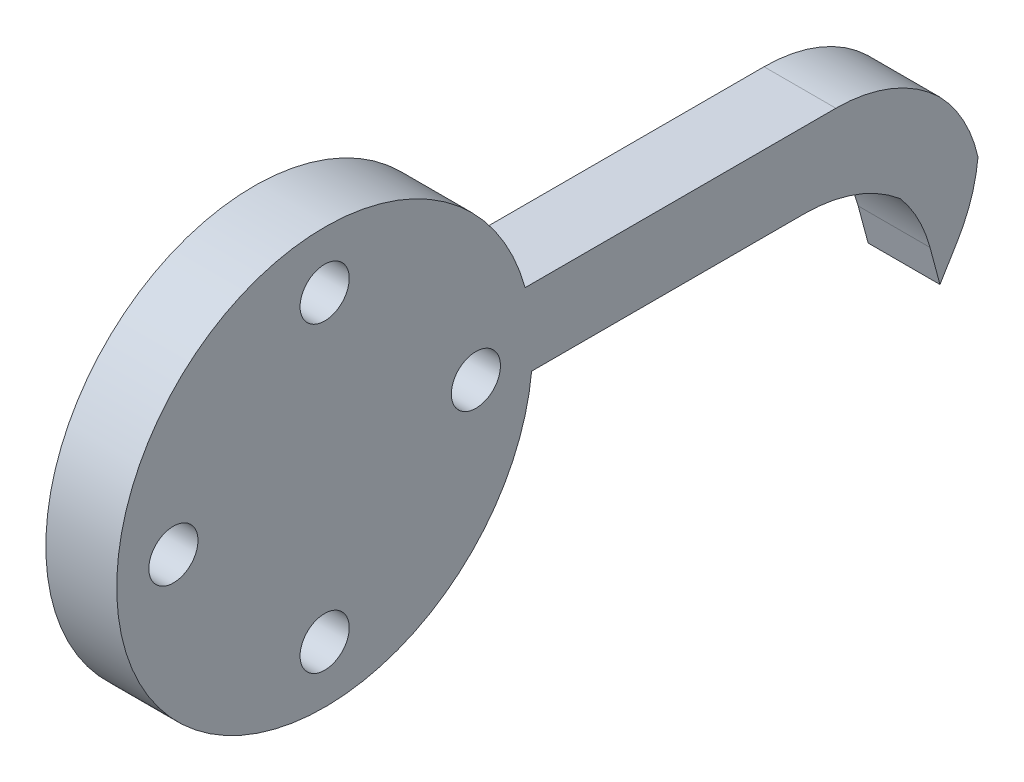
ISO-10303-21;
HEADER;
FILE_DESCRIPTION(('STEP AP214'),'2;1');
FILE_NAME('part.step','',(''),(''),'','','');
FILE_SCHEMA(('AUTOMOTIVE_DESIGN { 1 0 10303 214 1 1 1 1 }'));
ENDSEC;
DATA;
#1=APPLICATION_CONTEXT('core data for automotive mechanical design processes');
#2=APPLICATION_PROTOCOL_DEFINITION('international standard','automotive_design',2000,#1);
#3=PRODUCT_CONTEXT('',#1,'mechanical');
#4=PRODUCT('Part','Part','',(#3));
#5=PRODUCT_RELATED_PRODUCT_CATEGORY('part','',(#4));
#6=PRODUCT_DEFINITION_FORMATION('','',#4);
#7=PRODUCT_DEFINITION_CONTEXT('part definition',#1,'design');
#8=PRODUCT_DEFINITION('design','',#6,#7);
#9=PRODUCT_DEFINITION_SHAPE('','',#8);
#10=(LENGTH_UNIT() NAMED_UNIT(*) SI_UNIT(.MILLI.,.METRE.));
#11=(NAMED_UNIT(*) PLANE_ANGLE_UNIT() SI_UNIT($,.RADIAN.));
#12=(NAMED_UNIT(*) SI_UNIT($,.STERADIAN.) SOLID_ANGLE_UNIT());
#13=UNCERTAINTY_MEASURE_WITH_UNIT(LENGTH_MEASURE(1.E-05),#10,'distance_accuracy_value','');
#14=(GEOMETRIC_REPRESENTATION_CONTEXT(3) GLOBAL_UNCERTAINTY_ASSIGNED_CONTEXT((#13)) GLOBAL_UNIT_ASSIGNED_CONTEXT((#10,
#11,#12)) REPRESENTATION_CONTEXT('',''));
#15=CARTESIAN_POINT('',(0.,0.,0.));
#16=DIRECTION('',(0.,0.,1.));
#17=DIRECTION('',(1.,0.,0.));
#18=AXIS2_PLACEMENT_3D('',#15,#16,#17);
#19=CARTESIAN_POINT('',(4.7625,0.,0.));
#20=DIRECTION('',(1.,0.,0.));
#21=DIRECTION('',(0.,0.,-1.));
#22=AXIS2_PLACEMENT_3D('',#19,#20,#21);
#23=PLANE('',#22);
#24=CARTESIAN_POINT('',(4.7625,-6.07166926218671,-34.1297947618021));
#25=DIRECTION('',(1.,0.,0.));
#26=DIRECTION('',(0.,0.,-1.));
#27=AXIS2_PLACEMENT_3D('',#24,#25,#26);
#28=CIRCLE('',#27,10.);
#29=CARTESIAN_POINT('',(4.7625,-3.90232573338417,-43.8916567078677));
#30=VERTEX_POINT('',#29);
#31=CARTESIAN_POINT('',(4.7625,0.891421535927287,-41.3072153665334));
#32=VERTEX_POINT('',#31);
#33=EDGE_CURVE('E223',#30,#32,#28,.T.);
#34=ORIENTED_EDGE('',*,*,#33,.T.);
#35=CARTESIAN_POINT('',(4.7625,-6.28599906880401,-34.3441245684194));
#36=DIRECTION('',(1.,0.,0.));
#37=DIRECTION('',(0.,0.,-1.));
#38=AXIS2_PLACEMENT_3D('',#35,#36,#37);
#39=CIRCLE('',#38,10.);
#40=CARTESIAN_POINT('',(4.7625,3.71400093119599,-34.3441245684195));
#41=VERTEX_POINT('',#40);
#42=EDGE_CURVE('E225',#32,#41,#39,.T.);
#43=ORIENTED_EDGE('',*,*,#42,.T.);
#44=DIRECTION('',(0.,0.,1.));
#45=VECTOR('',#44,1.);
#46=CARTESIAN_POINT('',(4.7625,3.71400093119619,-13.4672601921502));
#47=LINE('',#46,#45);
#48=CARTESIAN_POINT('',(4.7625,3.71400093119619,-13.4672601921502));
#49=VERTEX_POINT('',#48);
#50=EDGE_CURVE('E154',#41,#49,#47,.T.);
#51=ORIENTED_EDGE('',*,*,#50,.T.);
#52=CARTESIAN_POINT('',(4.7625,0.,0.));
#53=DIRECTION('',(1.,0.,0.));
#54=DIRECTION('',(0.,0.,-1.));
#55=AXIS2_PLACEMENT_3D('',#52,#53,#54);
#56=CIRCLE('',#55,13.97);
#57=CARTESIAN_POINT('',(4.7625,-1.3659990688038,-13.9030552952949));
#58=VERTEX_POINT('',#57);
#59=EDGE_CURVE('E203',#49,#58,#56,.T.);
#60=ORIENTED_EDGE('',*,*,#59,.T.);
#61=DIRECTION('',(0.,0.,-1.));
#62=VECTOR('',#61,1.);
#63=CARTESIAN_POINT('',(4.7625,-1.3659990688038,-13.9030552952949));
#64=LINE('',#63,#62);
#65=CARTESIAN_POINT('',(4.7625,-1.3659990688038,-32.2399196715639));
#66=VERTEX_POINT('',#65);
#67=EDGE_CURVE('E164',#58,#66,#64,.T.);
#68=ORIENTED_EDGE('',*,*,#67,.T.);
#69=CARTESIAN_POINT('',(4.7625,-11.3659990688038,-32.2399196715639));
#70=DIRECTION('',(1.,0.,0.));
#71=DIRECTION('',(0.,0.,-1.));
#72=AXIS2_PLACEMENT_3D('',#69,#70,#71);
#73=CIRCLE('',#72,10.);
#74=CARTESIAN_POINT('',(4.7625,-3.70603449454337,-38.6683675963025));
#75=VERTEX_POINT('',#74);
#76=EDGE_CURVE('E50',#66,#75,#73,.F.);
#77=ORIENTED_EDGE('',*,*,#76,.T.);
#78=CARTESIAN_POINT('',(4.7625,-10.1344824192819,-31.008403022042));
#79=DIRECTION('',(1.,0.,0.));
#80=DIRECTION('',(0.,0.,-1.));
#81=AXIS2_PLACEMENT_3D('',#78,#79,#80);
#82=CIRCLE('',#81,10.);
#83=CARTESIAN_POINT('',(4.7625,-7.5462919682567,-40.6676612849327));
#84=VERTEX_POINT('',#83);
#85=EDGE_CURVE('E238',#75,#84,#82,.F.);
#86=ORIENTED_EDGE('',*,*,#85,.T.);
#87=DIRECTION('',(0.,-0.96592582628907,-0.258819045102517));
#88=VECTOR('',#87,1.);
#89=CARTESIAN_POINT('',(4.7625,-4.95810151723148,-39.9741577437225));
#90=LINE('',#89,#88);
#91=CARTESIAN_POINT('',(4.7625,-10.0381015172315,-41.3353396412726));
#92=VERTEX_POINT('',#91);
#93=EDGE_CURVE('E166',#84,#92,#90,.T.);
#94=ORIENTED_EDGE('',*,*,#93,.T.);
#95=DIRECTION('',(0.,0.853758675625453,-0.520668919558555));
#96=VECTOR('',#95,1.);
#97=CARTESIAN_POINT('',(4.7625,-5.48415274144533,-44.112587658198));
#98=LINE('',#97,#96);
#99=CARTESIAN_POINT('',(4.7625,-8.17229222132199,-42.4732125999185));
#100=VERTEX_POINT('',#99);
#101=EDGE_CURVE('E156',#92,#100,#98,.T.);
#102=ORIENTED_EDGE('',*,*,#101,.T.);
#103=CARTESIAN_POINT('',(4.7625,-2.96560302573644,-33.935625843664));
#104=DIRECTION('',(1.,0.,0.));
#105=DIRECTION('',(0.,0.,-1.));
#106=AXIS2_PLACEMENT_3D('',#103,#104,#105);
#107=CIRCLE('',#106,10.);
#108=EDGE_CURVE('E221',#100,#30,#107,.T.);
#109=ORIENTED_EDGE('',*,*,#108,.T.);
#110=EDGE_LOOP('',(#34,#43,#51,#60,#68,#77,#86,#94,#102,#109));
#111=FACE_BOUND('',#110,.T.);
#112=CARTESIAN_POINT('',(4.7625,0.,-10.16));
#113=DIRECTION('',(1.,0.,0.));
#114=DIRECTION('',(0.,0.,-1.));
#115=AXIS2_PLACEMENT_3D('',#112,#113,#114);
#116=CIRCLE('',#115,1.651);
#117=CARTESIAN_POINT('',(4.7625,0.,-8.509));
#118=VERTEX_POINT('',#117);
#119=EDGE_CURVE('E185',#118,#118,#116,.T.);
#120=ORIENTED_EDGE('',*,*,#119,.F.);
#121=EDGE_LOOP('',(#120));
#122=FACE_BOUND('',#121,.T.);
#123=CARTESIAN_POINT('',(4.7625,0.,10.16));
#124=DIRECTION('',(1.,0.,0.));
#125=DIRECTION('',(0.,0.,-1.));
#126=AXIS2_PLACEMENT_3D('',#123,#124,#125);
#127=CIRCLE('',#126,1.651);
#128=CARTESIAN_POINT('',(4.7625,0.,11.811));
#129=VERTEX_POINT('',#128);
#130=EDGE_CURVE('E197',#129,#129,#127,.T.);
#131=ORIENTED_EDGE('',*,*,#130,.F.);
#132=EDGE_LOOP('',(#131));
#133=FACE_BOUND('',#132,.T.);
#134=CARTESIAN_POINT('',(4.7625,10.16,0.));
#135=DIRECTION('',(1.,0.,0.));
#136=DIRECTION('',(0.,0.,-1.));
#137=AXIS2_PLACEMENT_3D('',#134,#135,#136);
#138=CIRCLE('',#137,1.651);
#139=CARTESIAN_POINT('',(4.7625,10.16,1.65099999999996));
#140=VERTEX_POINT('',#139);
#141=EDGE_CURVE('E191',#140,#140,#138,.T.);
#142=ORIENTED_EDGE('',*,*,#141,.F.);
#143=EDGE_LOOP('',(#142));
#144=FACE_BOUND('',#143,.T.);
#145=CARTESIAN_POINT('',(4.7625,-10.16,1.06420351207939E-13));
#146=DIRECTION('',(1.,0.,0.));
#147=DIRECTION('',(0.,0.,-1.));
#148=AXIS2_PLACEMENT_3D('',#145,#146,#147);
#149=CIRCLE('',#148,1.651);
#150=CARTESIAN_POINT('',(4.7625,-10.16,1.65100000000011));
#151=VERTEX_POINT('',#150);
#152=EDGE_CURVE('E179',#151,#151,#149,.T.);
#153=ORIENTED_EDGE('',*,*,#152,.F.);
#154=EDGE_LOOP('',(#153));
#155=FACE_BOUND('',#154,.T.);
#156=ADVANCED_FACE('F41',(#111,#122,#133,#144,#155),#23,.T.);
#157=CARTESIAN_POINT('',(0.,0.,0.));
#158=DIRECTION('',(1.,0.,0.));
#159=DIRECTION('',(0.,0.,-1.));
#160=AXIS2_PLACEMENT_3D('',#157,#158,#159);
#161=PLANE('',#160);
#162=CARTESIAN_POINT('',(0.,0.,0.));
#163=DIRECTION('',(1.,0.,0.));
#164=DIRECTION('',(0.,0.,-1.));
#165=AXIS2_PLACEMENT_3D('',#162,#163,#164);
#166=CIRCLE('',#165,13.97);
#167=CARTESIAN_POINT('',(0.,3.71400093119619,-13.4672601921502));
#168=VERTEX_POINT('',#167);
#169=CARTESIAN_POINT('',(0.,-1.3659990688038,-13.9030552952949));
#170=VERTEX_POINT('',#169);
#171=EDGE_CURVE('E200',#168,#170,#166,.T.);
#172=ORIENTED_EDGE('',*,*,#171,.F.);
#173=DIRECTION('',(0.,0.,1.));
#174=VECTOR('',#173,1.);
#175=CARTESIAN_POINT('',(0.,3.71400093119632,0.));
#176=LINE('',#175,#174);
#177=CARTESIAN_POINT('',(0.,3.7140009311962,-12.4564646299376));
#178=VERTEX_POINT('',#177);
#179=EDGE_CURVE('E175',#168,#178,#176,.T.);
#180=ORIENTED_EDGE('',*,*,#179,.T.);
#181=DIRECTION('',(0.,-1.,0.));
#182=VECTOR('',#181,1.);
#183=CARTESIAN_POINT('',(0.,0.,-12.4564646299376));
#184=LINE('',#183,#182);
#185=CARTESIAN_POINT('',(0.,-1.3659990688038,-12.4564646299376));
#186=VERTEX_POINT('',#185);
#187=EDGE_CURVE('E214',#178,#186,#184,.T.);
#188=ORIENTED_EDGE('',*,*,#187,.T.);
#189=DIRECTION('',(0.,0.,-1.));
#190=VECTOR('',#189,1.);
#191=CARTESIAN_POINT('',(0.,-1.3659990688038,0.));
#192=LINE('',#191,#190);
#193=EDGE_CURVE('E137',#186,#170,#192,.T.);
#194=ORIENTED_EDGE('',*,*,#193,.T.);
#195=EDGE_LOOP('',(#172,#180,#188,#194));
#196=FACE_BOUND('',#195,.T.);
#197=CARTESIAN_POINT('',(0.,0.,10.16));
#198=DIRECTION('',(1.,0.,0.));
#199=DIRECTION('',(0.,0.,-1.));
#200=AXIS2_PLACEMENT_3D('',#197,#198,#199);
#201=CIRCLE('',#200,1.651);
#202=CARTESIAN_POINT('',(0.,0.,11.811));
#203=VERTEX_POINT('',#202);
#204=EDGE_CURVE('E194',#203,#203,#201,.T.);
#205=ORIENTED_EDGE('',*,*,#204,.T.);
#206=EDGE_LOOP('',(#205));
#207=FACE_BOUND('',#206,.T.);
#208=CARTESIAN_POINT('',(0.,10.16,0.));
#209=DIRECTION('',(1.,0.,0.));
#210=DIRECTION('',(0.,0.,-1.));
#211=AXIS2_PLACEMENT_3D('',#208,#209,#210);
#212=CIRCLE('',#211,1.651);
#213=CARTESIAN_POINT('',(0.,10.16,1.65099999999996));
#214=VERTEX_POINT('',#213);
#215=EDGE_CURVE('E188',#214,#214,#212,.T.);
#216=ORIENTED_EDGE('',*,*,#215,.T.);
#217=EDGE_LOOP('',(#216));
#218=FACE_BOUND('',#217,.T.);
#219=CARTESIAN_POINT('',(0.,0.,-10.16));
#220=DIRECTION('',(1.,0.,0.));
#221=DIRECTION('',(0.,0.,-1.));
#222=AXIS2_PLACEMENT_3D('',#219,#220,#221);
#223=CIRCLE('',#222,1.651);
#224=CARTESIAN_POINT('',(0.,0.,-8.509));
#225=VERTEX_POINT('',#224);
#226=EDGE_CURVE('E182',#225,#225,#223,.T.);
#227=ORIENTED_EDGE('',*,*,#226,.T.);
#228=EDGE_LOOP('',(#227));
#229=FACE_BOUND('',#228,.T.);
#230=CARTESIAN_POINT('',(0.,-10.16,1.06420351207939E-13));
#231=DIRECTION('',(1.,0.,0.));
#232=DIRECTION('',(0.,0.,-1.));
#233=AXIS2_PLACEMENT_3D('',#230,#231,#232);
#234=CIRCLE('',#233,1.651);
#235=CARTESIAN_POINT('',(0.,-10.16,1.65100000000011));
#236=VERTEX_POINT('',#235);
#237=EDGE_CURVE('E178',#236,#236,#234,.T.);
#238=ORIENTED_EDGE('',*,*,#237,.T.);
#239=EDGE_LOOP('',(#238));
#240=FACE_BOUND('',#239,.T.);
#241=ADVANCED_FACE('F280',(#196,#207,#218,#229,#240),#161,.F.);
#242=CARTESIAN_POINT('',(4.7625,0.,0.));
#243=DIRECTION('',(-1.,0.,0.));
#244=DIRECTION('',(0.,0.,1.));
#245=AXIS2_PLACEMENT_3D('',#242,#243,#244);
#246=CYLINDRICAL_SURFACE('',#245,13.97);
#247=ORIENTED_EDGE('',*,*,#59,.F.);
#248=DIRECTION('',(-1.,0.,0.));
#249=VECTOR('',#248,1.);
#250=CARTESIAN_POINT('',(4.7625,3.71400093119619,-13.4672601921502));
#251=LINE('',#250,#249);
#252=EDGE_CURVE('E211',#49,#168,#251,.T.);
#253=ORIENTED_EDGE('',*,*,#252,.T.);
#254=ORIENTED_EDGE('',*,*,#171,.T.);
#255=DIRECTION('',(-1.,0.,0.));
#256=VECTOR('',#255,1.);
#257=CARTESIAN_POINT('',(4.7625,-1.3659990688038,-13.9030552952949));
#258=LINE('',#257,#256);
#259=EDGE_CURVE('E206',#170,#58,#258,.F.);
#260=ORIENTED_EDGE('',*,*,#259,.T.);
#261=EDGE_LOOP('',(#247,#253,#254,#260));
#262=FACE_BOUND('',#261,.T.);
#263=ADVANCED_FACE('F277',(#262),#246,.T.);
#264=CARTESIAN_POINT('',(4.7625,0.,10.16));
#265=DIRECTION('',(-1.,0.,0.));
#266=DIRECTION('',(0.,0.,1.));
#267=AXIS2_PLACEMENT_3D('',#264,#265,#266);
#268=CYLINDRICAL_SURFACE('',#267,1.651);
#269=CARTESIAN_POINT('',(4.7625,0.,11.811));
#270=CARTESIAN_POINT('',(4.712890625,0.,11.811));
#271=CARTESIAN_POINT('',(4.66328125,0.,11.811));
#272=CARTESIAN_POINT('',(4.5640625,0.,11.811));
#273=CARTESIAN_POINT('',(4.514453125,0.,11.811));
#274=CARTESIAN_POINT('',(4.415234375,0.,11.811));
#275=CARTESIAN_POINT('',(4.365625,0.,11.811));
#276=CARTESIAN_POINT('',(4.26640625,0.,11.811));
#277=CARTESIAN_POINT('',(4.216796875,0.,11.811));
#278=CARTESIAN_POINT('',(4.117578125,0.,11.811));
#279=CARTESIAN_POINT('',(4.06796875,0.,11.811));
#280=CARTESIAN_POINT('',(3.96875,0.,11.811));
#281=CARTESIAN_POINT('',(3.919140625,0.,11.811));
#282=CARTESIAN_POINT('',(3.819921875,0.,11.811));
#283=CARTESIAN_POINT('',(3.7703125,0.,11.811));
#284=CARTESIAN_POINT('',(3.67109375,0.,11.811));
#285=CARTESIAN_POINT('',(3.621484375,0.,11.811));
#286=CARTESIAN_POINT('',(3.522265625,0.,11.811));
#287=CARTESIAN_POINT('',(3.47265625,0.,11.811));
#288=CARTESIAN_POINT('',(3.3734375,0.,11.811));
#289=CARTESIAN_POINT('',(3.323828125,0.,11.811));
#290=CARTESIAN_POINT('',(3.224609375,0.,11.811));
#291=CARTESIAN_POINT('',(3.175,0.,11.811));
#292=CARTESIAN_POINT('',(3.07578125,0.,11.811));
#293=CARTESIAN_POINT('',(3.026171875,0.,11.811));
#294=CARTESIAN_POINT('',(2.926953125,0.,11.811));
#295=CARTESIAN_POINT('',(2.87734375,0.,11.811));
#296=CARTESIAN_POINT('',(2.778125,0.,11.811));
#297=CARTESIAN_POINT('',(2.728515625,0.,11.811));
#298=CARTESIAN_POINT('',(2.629296875,0.,11.811));
#299=CARTESIAN_POINT('',(2.5796875,0.,11.811));
#300=CARTESIAN_POINT('',(2.48046875,0.,11.811));
#301=CARTESIAN_POINT('',(2.430859375,0.,11.811));
#302=CARTESIAN_POINT('',(2.331640625,0.,11.811));
#303=CARTESIAN_POINT('',(2.28203125,0.,11.811));
#304=CARTESIAN_POINT('',(2.1828125,0.,11.811));
#305=CARTESIAN_POINT('',(2.133203125,0.,11.811));
#306=CARTESIAN_POINT('',(2.033984375,0.,11.811));
#307=CARTESIAN_POINT('',(1.984375,0.,11.811));
#308=CARTESIAN_POINT('',(1.88515625,0.,11.811));
#309=CARTESIAN_POINT('',(1.835546875,0.,11.811));
#310=CARTESIAN_POINT('',(1.736328125,0.,11.811));
#311=CARTESIAN_POINT('',(1.68671875,0.,11.811));
#312=CARTESIAN_POINT('',(1.5875,0.,11.811));
#313=CARTESIAN_POINT('',(1.537890625,0.,11.811));
#314=CARTESIAN_POINT('',(1.438671875,0.,11.811));
#315=CARTESIAN_POINT('',(1.3890625,0.,11.811));
#316=CARTESIAN_POINT('',(1.28984375,0.,11.811));
#317=CARTESIAN_POINT('',(1.240234375,0.,11.811));
#318=CARTESIAN_POINT('',(1.141015625,0.,11.811));
#319=CARTESIAN_POINT('',(1.09140625,0.,11.811));
#320=CARTESIAN_POINT('',(0.9921875,0.,11.811));
#321=CARTESIAN_POINT('',(0.942578125,0.,11.811));
#322=CARTESIAN_POINT('',(0.843359375,0.,11.811));
#323=CARTESIAN_POINT('',(0.79375,0.,11.811));
#324=CARTESIAN_POINT('',(0.69453125,0.,11.811));
#325=CARTESIAN_POINT('',(0.644921875,0.,11.811));
#326=CARTESIAN_POINT('',(0.545703125,0.,11.811));
#327=CARTESIAN_POINT('',(0.49609375,0.,11.811));
#328=CARTESIAN_POINT('',(0.396875,0.,11.811));
#329=CARTESIAN_POINT('',(0.347265625,0.,11.811));
#330=CARTESIAN_POINT('',(0.248046875,0.,11.811));
#331=CARTESIAN_POINT('',(0.1984375,0.,11.811));
#332=CARTESIAN_POINT('',(0.09921875,0.,11.811));
#333=CARTESIAN_POINT('',(0.049609375,0.,11.811));
#334=CARTESIAN_POINT('',(0.,0.,11.811));
#335=B_SPLINE_CURVE_WITH_KNOTS('',3,(#269,#270,#271,#272,#273,#274,#275,#276,#277,#278,#279,
#280,#281,#282,#283,#284,#285,#286,#287,#288,#289,#290,#291,#292,#293,#294,#295,#296,#297,#298,
#299,#300,#301,#302,#303,#304,#305,#306,#307,#308,#309,#310,#311,#312,#313,#314,#315,#316,#317,
#318,#319,#320,#321,#322,#323,#324,#325,#326,#327,#328,#329,#330,#331,#332,#333,#334),
.UNSPECIFIED.,.F.,.F.,(4,2,2,2,2,2,2,2,2,2,2,2,2,2,2,2,2,2,2,2,2,2,2,2,2,2,2,2,2,2,2,2,4),(0.,
0.148828124999999,0.297656249999999,0.446484374999999,0.595312499999999,0.744140625,0.89296875,
1.041796875,1.190625,1.339453125,1.48828125,1.637109375,1.7859375,1.934765625,2.08359375,
2.232421875,2.38125,2.530078125,2.67890625,2.827734375,2.9765625,3.125390625,3.27421875,
3.423046875,3.571875,3.720703125,3.86953125,4.018359375,4.1671875,4.316015625,4.46484375,
4.613671875,4.7625),.UNSPECIFIED.);
#336=EDGE_CURVE('BSEAM299',#129,#203,#335,.T.);
#337=ORIENTED_EDGE('',*,*,#130,.T.);
#338=ORIENTED_EDGE('',*,*,#204,.F.);
#339=ORIENTED_EDGE('',*,*,#336,.T.);
#340=ORIENTED_EDGE('',*,*,#336,.F.);
#341=EDGE_LOOP('',(#337,#339,#338,#340));
#342=FACE_BOUND('',#341,.T.);
#343=ADVANCED_FACE('F299',(#342),#268,.F.);
#344=CARTESIAN_POINT('',(4.7625,10.16,0.));
#345=DIRECTION('',(-1.,0.,0.));
#346=DIRECTION('',(0.,0.,1.));
#347=AXIS2_PLACEMENT_3D('',#344,#345,#346);
#348=CYLINDRICAL_SURFACE('',#347,1.651);
#349=CARTESIAN_POINT('',(4.7625,10.16,1.65099999999996));
#350=CARTESIAN_POINT('',(4.712890625,10.16,1.65099999999996));
#351=CARTESIAN_POINT('',(4.66328125,10.16,1.65099999999996));
#352=CARTESIAN_POINT('',(4.5640625,10.16,1.65099999999996));
#353=CARTESIAN_POINT('',(4.514453125,10.16,1.65099999999996));
#354=CARTESIAN_POINT('',(4.415234375,10.16,1.65099999999996));
#355=CARTESIAN_POINT('',(4.365625,10.16,1.65099999999996));
#356=CARTESIAN_POINT('',(4.26640625,10.16,1.65099999999996));
#357=CARTESIAN_POINT('',(4.216796875,10.16,1.65099999999996));
#358=CARTESIAN_POINT('',(4.117578125,10.16,1.65099999999996));
#359=CARTESIAN_POINT('',(4.06796875,10.16,1.65099999999996));
#360=CARTESIAN_POINT('',(3.96875,10.16,1.65099999999996));
#361=CARTESIAN_POINT('',(3.919140625,10.16,1.65099999999996));
#362=CARTESIAN_POINT('',(3.819921875,10.16,1.65099999999996));
#363=CARTESIAN_POINT('',(3.7703125,10.16,1.65099999999996));
#364=CARTESIAN_POINT('',(3.67109375,10.16,1.65099999999996));
#365=CARTESIAN_POINT('',(3.621484375,10.16,1.65099999999996));
#366=CARTESIAN_POINT('',(3.522265625,10.16,1.65099999999996));
#367=CARTESIAN_POINT('',(3.47265625,10.16,1.65099999999996));
#368=CARTESIAN_POINT('',(3.3734375,10.16,1.65099999999996));
#369=CARTESIAN_POINT('',(3.323828125,10.16,1.65099999999996));
#370=CARTESIAN_POINT('',(3.224609375,10.16,1.65099999999996));
#371=CARTESIAN_POINT('',(3.175,10.16,1.65099999999996));
#372=CARTESIAN_POINT('',(3.07578125,10.16,1.65099999999996));
#373=CARTESIAN_POINT('',(3.026171875,10.16,1.65099999999996));
#374=CARTESIAN_POINT('',(2.926953125,10.16,1.65099999999996));
#375=CARTESIAN_POINT('',(2.87734375,10.16,1.65099999999996));
#376=CARTESIAN_POINT('',(2.778125,10.16,1.65099999999996));
#377=CARTESIAN_POINT('',(2.728515625,10.16,1.65099999999996));
#378=CARTESIAN_POINT('',(2.629296875,10.16,1.65099999999996));
#379=CARTESIAN_POINT('',(2.5796875,10.16,1.65099999999996));
#380=CARTESIAN_POINT('',(2.48046875,10.16,1.65099999999996));
#381=CARTESIAN_POINT('',(2.430859375,10.16,1.65099999999996));
#382=CARTESIAN_POINT('',(2.331640625,10.16,1.65099999999996));
#383=CARTESIAN_POINT('',(2.28203125,10.16,1.65099999999996));
#384=CARTESIAN_POINT('',(2.1828125,10.16,1.65099999999996));
#385=CARTESIAN_POINT('',(2.133203125,10.16,1.65099999999996));
#386=CARTESIAN_POINT('',(2.033984375,10.16,1.65099999999996));
#387=CARTESIAN_POINT('',(1.984375,10.16,1.65099999999996));
#388=CARTESIAN_POINT('',(1.88515625,10.16,1.65099999999996));
#389=CARTESIAN_POINT('',(1.835546875,10.16,1.65099999999996));
#390=CARTESIAN_POINT('',(1.736328125,10.16,1.65099999999996));
#391=CARTESIAN_POINT('',(1.68671875,10.16,1.65099999999996));
#392=CARTESIAN_POINT('',(1.5875,10.16,1.65099999999996));
#393=CARTESIAN_POINT('',(1.537890625,10.16,1.65099999999996));
#394=CARTESIAN_POINT('',(1.438671875,10.16,1.65099999999996));
#395=CARTESIAN_POINT('',(1.3890625,10.16,1.65099999999996));
#396=CARTESIAN_POINT('',(1.28984375,10.16,1.65099999999996));
#397=CARTESIAN_POINT('',(1.240234375,10.16,1.65099999999996));
#398=CARTESIAN_POINT('',(1.141015625,10.16,1.65099999999996));
#399=CARTESIAN_POINT('',(1.09140625,10.16,1.65099999999996));
#400=CARTESIAN_POINT('',(0.9921875,10.16,1.65099999999996));
#401=CARTESIAN_POINT('',(0.942578125,10.16,1.65099999999996));
#402=CARTESIAN_POINT('',(0.843359375,10.16,1.65099999999996));
#403=CARTESIAN_POINT('',(0.79375,10.16,1.65099999999996));
#404=CARTESIAN_POINT('',(0.69453125,10.16,1.65099999999996));
#405=CARTESIAN_POINT('',(0.644921875,10.16,1.65099999999996));
#406=CARTESIAN_POINT('',(0.545703125,10.16,1.65099999999996));
#407=CARTESIAN_POINT('',(0.49609375,10.16,1.65099999999996));
#408=CARTESIAN_POINT('',(0.396875,10.16,1.65099999999996));
#409=CARTESIAN_POINT('',(0.347265625,10.16,1.65099999999996));
#410=CARTESIAN_POINT('',(0.248046875,10.16,1.65099999999996));
#411=CARTESIAN_POINT('',(0.1984375,10.16,1.65099999999996));
#412=CARTESIAN_POINT('',(0.09921875,10.16,1.65099999999996));
#413=CARTESIAN_POINT('',(0.049609375,10.16,1.65099999999996));
#414=CARTESIAN_POINT('',(0.,10.16,1.65099999999996));
#415=B_SPLINE_CURVE_WITH_KNOTS('',3,(#349,#350,#351,#352,#353,#354,#355,#356,#357,#358,#359,
#360,#361,#362,#363,#364,#365,#366,#367,#368,#369,#370,#371,#372,#373,#374,#375,#376,#377,#378,
#379,#380,#381,#382,#383,#384,#385,#386,#387,#388,#389,#390,#391,#392,#393,#394,#395,#396,#397,
#398,#399,#400,#401,#402,#403,#404,#405,#406,#407,#408,#409,#410,#411,#412,#413,#414),
.UNSPECIFIED.,.F.,.F.,(4,2,2,2,2,2,2,2,2,2,2,2,2,2,2,2,2,2,2,2,2,2,2,2,2,2,2,2,2,2,2,2,4),(0.,
0.148828124999999,0.297656249999999,0.446484374999999,0.595312499999999,0.744140625,0.89296875,
1.041796875,1.190625,1.339453125,1.48828125,1.637109375,1.7859375,1.934765625,2.08359375,
2.232421875,2.38125,2.530078125,2.67890625,2.827734375,2.9765625,3.125390625,3.27421875,
3.423046875,3.571875,3.720703125,3.86953125,4.018359375,4.1671875,4.316015625,4.46484375,
4.613671875,4.7625),.UNSPECIFIED.);
#416=EDGE_CURVE('BSEAM329',#140,#214,#415,.T.);
#417=ORIENTED_EDGE('',*,*,#141,.T.);
#418=ORIENTED_EDGE('',*,*,#215,.F.);
#419=ORIENTED_EDGE('',*,*,#416,.T.);
#420=ORIENTED_EDGE('',*,*,#416,.F.);
#421=EDGE_LOOP('',(#417,#419,#418,#420));
#422=FACE_BOUND('',#421,.T.);
#423=ADVANCED_FACE('F329',(#422),#348,.F.);
#424=CARTESIAN_POINT('',(4.7625,0.,-10.16));
#425=DIRECTION('',(-1.,0.,0.));
#426=DIRECTION('',(0.,0.,1.));
#427=AXIS2_PLACEMENT_3D('',#424,#425,#426);
#428=CYLINDRICAL_SURFACE('',#427,1.651);
#429=CARTESIAN_POINT('',(4.7625,0.,-8.509));
#430=CARTESIAN_POINT('',(4.712890625,0.,-8.509));
#431=CARTESIAN_POINT('',(4.66328125,0.,-8.509));
#432=CARTESIAN_POINT('',(4.5640625,0.,-8.509));
#433=CARTESIAN_POINT('',(4.514453125,0.,-8.509));
#434=CARTESIAN_POINT('',(4.415234375,0.,-8.509));
#435=CARTESIAN_POINT('',(4.365625,0.,-8.509));
#436=CARTESIAN_POINT('',(4.26640625,0.,-8.509));
#437=CARTESIAN_POINT('',(4.216796875,0.,-8.509));
#438=CARTESIAN_POINT('',(4.117578125,0.,-8.509));
#439=CARTESIAN_POINT('',(4.06796875,0.,-8.509));
#440=CARTESIAN_POINT('',(3.96875,0.,-8.509));
#441=CARTESIAN_POINT('',(3.919140625,0.,-8.509));
#442=CARTESIAN_POINT('',(3.819921875,0.,-8.509));
#443=CARTESIAN_POINT('',(3.7703125,0.,-8.509));
#444=CARTESIAN_POINT('',(3.67109375,0.,-8.509));
#445=CARTESIAN_POINT('',(3.621484375,0.,-8.509));
#446=CARTESIAN_POINT('',(3.522265625,0.,-8.509));
#447=CARTESIAN_POINT('',(3.47265625,0.,-8.509));
#448=CARTESIAN_POINT('',(3.3734375,0.,-8.509));
#449=CARTESIAN_POINT('',(3.323828125,0.,-8.509));
#450=CARTESIAN_POINT('',(3.224609375,0.,-8.509));
#451=CARTESIAN_POINT('',(3.175,0.,-8.509));
#452=CARTESIAN_POINT('',(3.07578125,0.,-8.509));
#453=CARTESIAN_POINT('',(3.026171875,0.,-8.509));
#454=CARTESIAN_POINT('',(2.926953125,0.,-8.509));
#455=CARTESIAN_POINT('',(2.87734375,0.,-8.509));
#456=CARTESIAN_POINT('',(2.778125,0.,-8.509));
#457=CARTESIAN_POINT('',(2.728515625,0.,-8.509));
#458=CARTESIAN_POINT('',(2.629296875,0.,-8.509));
#459=CARTESIAN_POINT('',(2.5796875,0.,-8.509));
#460=CARTESIAN_POINT('',(2.48046875,0.,-8.509));
#461=CARTESIAN_POINT('',(2.430859375,0.,-8.509));
#462=CARTESIAN_POINT('',(2.331640625,0.,-8.509));
#463=CARTESIAN_POINT('',(2.28203125,0.,-8.509));
#464=CARTESIAN_POINT('',(2.1828125,0.,-8.509));
#465=CARTESIAN_POINT('',(2.133203125,0.,-8.509));
#466=CARTESIAN_POINT('',(2.033984375,0.,-8.509));
#467=CARTESIAN_POINT('',(1.984375,0.,-8.509));
#468=CARTESIAN_POINT('',(1.88515625,0.,-8.509));
#469=CARTESIAN_POINT('',(1.835546875,0.,-8.509));
#470=CARTESIAN_POINT('',(1.736328125,0.,-8.509));
#471=CARTESIAN_POINT('',(1.68671875,0.,-8.509));
#472=CARTESIAN_POINT('',(1.5875,0.,-8.509));
#473=CARTESIAN_POINT('',(1.537890625,0.,-8.509));
#474=CARTESIAN_POINT('',(1.438671875,0.,-8.509));
#475=CARTESIAN_POINT('',(1.3890625,0.,-8.509));
#476=CARTESIAN_POINT('',(1.28984375,0.,-8.509));
#477=CARTESIAN_POINT('',(1.240234375,0.,-8.509));
#478=CARTESIAN_POINT('',(1.141015625,0.,-8.509));
#479=CARTESIAN_POINT('',(1.09140625,0.,-8.509));
#480=CARTESIAN_POINT('',(0.9921875,0.,-8.509));
#481=CARTESIAN_POINT('',(0.942578125,0.,-8.509));
#482=CARTESIAN_POINT('',(0.843359375,0.,-8.509));
#483=CARTESIAN_POINT('',(0.79375,0.,-8.509));
#484=CARTESIAN_POINT('',(0.69453125,0.,-8.509));
#485=CARTESIAN_POINT('',(0.644921875,0.,-8.509));
#486=CARTESIAN_POINT('',(0.545703125,0.,-8.509));
#487=CARTESIAN_POINT('',(0.49609375,0.,-8.509));
#488=CARTESIAN_POINT('',(0.396875,0.,-8.509));
#489=CARTESIAN_POINT('',(0.347265625,0.,-8.509));
#490=CARTESIAN_POINT('',(0.248046875,0.,-8.509));
#491=CARTESIAN_POINT('',(0.1984375,0.,-8.509));
#492=CARTESIAN_POINT('',(0.09921875,0.,-8.509));
#493=CARTESIAN_POINT('',(0.049609375,0.,-8.509));
#494=CARTESIAN_POINT('',(0.,0.,-8.509));
#495=B_SPLINE_CURVE_WITH_KNOTS('',3,(#429,#430,#431,#432,#433,#434,#435,#436,#437,#438,#439,
#440,#441,#442,#443,#444,#445,#446,#447,#448,#449,#450,#451,#452,#453,#454,#455,#456,#457,#458,
#459,#460,#461,#462,#463,#464,#465,#466,#467,#468,#469,#470,#471,#472,#473,#474,#475,#476,#477,
#478,#479,#480,#481,#482,#483,#484,#485,#486,#487,#488,#489,#490,#491,#492,#493,#494),
.UNSPECIFIED.,.F.,.F.,(4,2,2,2,2,2,2,2,2,2,2,2,2,2,2,2,2,2,2,2,2,2,2,2,2,2,2,2,2,2,2,2,4),(0.,
0.148828124999999,0.297656249999999,0.446484374999999,0.595312499999999,0.744140625,0.89296875,
1.041796875,1.190625,1.339453125,1.48828125,1.637109375,1.7859375,1.934765625,2.08359375,
2.232421875,2.38125,2.530078125,2.67890625,2.827734375,2.9765625,3.125390625,3.27421875,
3.423046875,3.571875,3.720703125,3.86953125,4.018359375,4.1671875,4.316015625,4.46484375,
4.613671875,4.7625),.UNSPECIFIED.);
#496=EDGE_CURVE('BSEAM326',#118,#225,#495,.T.);
#497=ORIENTED_EDGE('',*,*,#119,.T.);
#498=ORIENTED_EDGE('',*,*,#226,.F.);
#499=ORIENTED_EDGE('',*,*,#496,.T.);
#500=ORIENTED_EDGE('',*,*,#496,.F.);
#501=EDGE_LOOP('',(#497,#499,#498,#500));
#502=FACE_BOUND('',#501,.T.);
#503=ADVANCED_FACE('F326',(#502),#428,.F.);
#504=CARTESIAN_POINT('',(4.7625,-10.16,1.06420351207939E-13));
#505=DIRECTION('',(-1.,0.,0.));
#506=DIRECTION('',(0.,0.,1.));
#507=AXIS2_PLACEMENT_3D('',#504,#505,#506);
#508=CYLINDRICAL_SURFACE('',#507,1.651);
#509=CARTESIAN_POINT('',(4.7625,-10.16,1.65100000000011));
#510=CARTESIAN_POINT('',(4.712890625,-10.16,1.65100000000011));
#511=CARTESIAN_POINT('',(4.66328125,-10.16,1.65100000000011));
#512=CARTESIAN_POINT('',(4.5640625,-10.16,1.65100000000011));
#513=CARTESIAN_POINT('',(4.514453125,-10.16,1.65100000000011));
#514=CARTESIAN_POINT('',(4.415234375,-10.16,1.65100000000011));
#515=CARTESIAN_POINT('',(4.365625,-10.16,1.65100000000011));
#516=CARTESIAN_POINT('',(4.26640625,-10.16,1.65100000000011));
#517=CARTESIAN_POINT('',(4.216796875,-10.16,1.65100000000011));
#518=CARTESIAN_POINT('',(4.117578125,-10.16,1.65100000000011));
#519=CARTESIAN_POINT('',(4.06796875,-10.16,1.65100000000011));
#520=CARTESIAN_POINT('',(3.96875,-10.16,1.65100000000011));
#521=CARTESIAN_POINT('',(3.919140625,-10.16,1.65100000000011));
#522=CARTESIAN_POINT('',(3.819921875,-10.16,1.65100000000011));
#523=CARTESIAN_POINT('',(3.7703125,-10.16,1.65100000000011));
#524=CARTESIAN_POINT('',(3.67109375,-10.16,1.65100000000011));
#525=CARTESIAN_POINT('',(3.621484375,-10.16,1.65100000000011));
#526=CARTESIAN_POINT('',(3.522265625,-10.16,1.65100000000011));
#527=CARTESIAN_POINT('',(3.47265625,-10.16,1.65100000000011));
#528=CARTESIAN_POINT('',(3.3734375,-10.16,1.65100000000011));
#529=CARTESIAN_POINT('',(3.323828125,-10.16,1.65100000000011));
#530=CARTESIAN_POINT('',(3.224609375,-10.16,1.65100000000011));
#531=CARTESIAN_POINT('',(3.175,-10.16,1.65100000000011));
#532=CARTESIAN_POINT('',(3.07578125,-10.16,1.65100000000011));
#533=CARTESIAN_POINT('',(3.026171875,-10.16,1.65100000000011));
#534=CARTESIAN_POINT('',(2.926953125,-10.16,1.65100000000011));
#535=CARTESIAN_POINT('',(2.87734375,-10.16,1.65100000000011));
#536=CARTESIAN_POINT('',(2.778125,-10.16,1.65100000000011));
#537=CARTESIAN_POINT('',(2.728515625,-10.16,1.65100000000011));
#538=CARTESIAN_POINT('',(2.629296875,-10.16,1.65100000000011));
#539=CARTESIAN_POINT('',(2.5796875,-10.16,1.65100000000011));
#540=CARTESIAN_POINT('',(2.48046875,-10.16,1.65100000000011));
#541=CARTESIAN_POINT('',(2.430859375,-10.16,1.65100000000011));
#542=CARTESIAN_POINT('',(2.331640625,-10.16,1.65100000000011));
#543=CARTESIAN_POINT('',(2.28203125,-10.16,1.65100000000011));
#544=CARTESIAN_POINT('',(2.1828125,-10.16,1.65100000000011));
#545=CARTESIAN_POINT('',(2.133203125,-10.16,1.65100000000011));
#546=CARTESIAN_POINT('',(2.033984375,-10.16,1.65100000000011));
#547=CARTESIAN_POINT('',(1.984375,-10.16,1.65100000000011));
#548=CARTESIAN_POINT('',(1.88515625,-10.16,1.65100000000011));
#549=CARTESIAN_POINT('',(1.835546875,-10.16,1.65100000000011));
#550=CARTESIAN_POINT('',(1.736328125,-10.16,1.65100000000011));
#551=CARTESIAN_POINT('',(1.68671875,-10.16,1.65100000000011));
#552=CARTESIAN_POINT('',(1.5875,-10.16,1.65100000000011));
#553=CARTESIAN_POINT('',(1.537890625,-10.16,1.65100000000011));
#554=CARTESIAN_POINT('',(1.438671875,-10.16,1.65100000000011));
#555=CARTESIAN_POINT('',(1.3890625,-10.16,1.65100000000011));
#556=CARTESIAN_POINT('',(1.28984375,-10.16,1.65100000000011));
#557=CARTESIAN_POINT('',(1.240234375,-10.16,1.65100000000011));
#558=CARTESIAN_POINT('',(1.141015625,-10.16,1.65100000000011));
#559=CARTESIAN_POINT('',(1.09140625,-10.16,1.65100000000011));
#560=CARTESIAN_POINT('',(0.9921875,-10.16,1.65100000000011));
#561=CARTESIAN_POINT('',(0.942578125,-10.16,1.65100000000011));
#562=CARTESIAN_POINT('',(0.843359375,-10.16,1.65100000000011));
#563=CARTESIAN_POINT('',(0.79375,-10.16,1.65100000000011));
#564=CARTESIAN_POINT('',(0.69453125,-10.16,1.65100000000011));
#565=CARTESIAN_POINT('',(0.644921875,-10.16,1.65100000000011));
#566=CARTESIAN_POINT('',(0.545703125,-10.16,1.65100000000011));
#567=CARTESIAN_POINT('',(0.49609375,-10.16,1.65100000000011));
#568=CARTESIAN_POINT('',(0.396875,-10.16,1.65100000000011));
#569=CARTESIAN_POINT('',(0.347265625,-10.16,1.65100000000011));
#570=CARTESIAN_POINT('',(0.248046875,-10.16,1.65100000000011));
#571=CARTESIAN_POINT('',(0.1984375,-10.16,1.65100000000011));
#572=CARTESIAN_POINT('',(0.09921875,-10.16,1.65100000000011));
#573=CARTESIAN_POINT('',(0.049609375,-10.16,1.65100000000011));
#574=CARTESIAN_POINT('',(0.,-10.16,1.65100000000011));
#575=B_SPLINE_CURVE_WITH_KNOTS('',3,(#509,#510,#511,#512,#513,#514,#515,#516,#517,#518,#519,
#520,#521,#522,#523,#524,#525,#526,#527,#528,#529,#530,#531,#532,#533,#534,#535,#536,#537,#538,
#539,#540,#541,#542,#543,#544,#545,#546,#547,#548,#549,#550,#551,#552,#553,#554,#555,#556,#557,
#558,#559,#560,#561,#562,#563,#564,#565,#566,#567,#568,#569,#570,#571,#572,#573,#574),
.UNSPECIFIED.,.F.,.F.,(4,2,2,2,2,2,2,2,2,2,2,2,2,2,2,2,2,2,2,2,2,2,2,2,2,2,2,2,2,2,2,2,4),(0.,
0.148828124999999,0.297656249999999,0.446484374999999,0.595312499999999,0.744140625,0.89296875,
1.041796875,1.190625,1.339453125,1.48828125,1.637109375,1.7859375,1.934765625,2.08359375,
2.232421875,2.38125,2.530078125,2.67890625,2.827734375,2.9765625,3.125390625,3.27421875,
3.423046875,3.571875,3.720703125,3.86953125,4.018359375,4.1671875,4.316015625,4.46484375,
4.613671875,4.7625),.UNSPECIFIED.);
#576=EDGE_CURVE('BSEAM323',#151,#236,#575,.T.);
#577=ORIENTED_EDGE('',*,*,#152,.T.);
#578=ORIENTED_EDGE('',*,*,#237,.F.);
#579=ORIENTED_EDGE('',*,*,#576,.T.);
#580=ORIENTED_EDGE('',*,*,#576,.F.);
#581=EDGE_LOOP('',(#577,#579,#578,#580));
#582=FACE_BOUND('',#581,.T.);
#583=ADVANCED_FACE('F323',(#582),#508,.F.);
#584=CARTESIAN_POINT('',(-0.0634999999999993,3.7140009311962,-12.4564646299376));
#585=DIRECTION('',(0.,0.,1.));
#586=DIRECTION('',(1.,0.,0.));
#587=AXIS2_PLACEMENT_3D('',#584,#585,#586);
#588=PLANE('',#587);
#589=ORIENTED_EDGE('',*,*,#187,.F.);
#590=DIRECTION('',(1.,0.,0.));
#591=VECTOR('',#590,1.);
#592=CARTESIAN_POINT('',(-0.0634999999999993,3.7140009311962,-12.4564646299376));
#593=LINE('',#592,#591);
#594=CARTESIAN_POINT('',(-0.0634999999999993,3.7140009311962,-12.4564646299376));
#595=VERTEX_POINT('',#594);
#596=EDGE_CURVE('E153',#595,#178,#593,.T.);
#597=ORIENTED_EDGE('',*,*,#596,.F.);
#598=DIRECTION('',(0.,-1.,0.));
#599=VECTOR('',#598,1.);
#600=CARTESIAN_POINT('',(-0.0634999999999993,3.7140009311962,-12.4564646299376));
#601=LINE('',#600,#599);
#602=CARTESIAN_POINT('',(-0.0634999999999993,-1.3659990688038,-12.4564646299376));
#603=VERTEX_POINT('',#602);
#604=EDGE_CURVE('E147',#595,#603,#601,.T.);
#605=ORIENTED_EDGE('',*,*,#604,.T.);
#606=DIRECTION('',(1.,0.,0.));
#607=VECTOR('',#606,1.);
#608=CARTESIAN_POINT('',(-0.0634999999999993,-1.3659990688038,-12.4564646299376));
#609=LINE('',#608,#607);
#610=EDGE_CURVE('E131',#603,#186,#609,.T.);
#611=ORIENTED_EDGE('',*,*,#610,.T.);
#612=EDGE_LOOP('',(#589,#597,#605,#611));
#613=FACE_BOUND('',#612,.T.);
#614=ADVANCED_FACE('F151',(#613),#588,.T.);
#615=CARTESIAN_POINT('',(-0.0634999999999993,3.71400093119619,-13.4672601921502));
#616=DIRECTION('',(0.,1.,0.));
#617=DIRECTION('',(0.,0.,1.));
#618=AXIS2_PLACEMENT_3D('',#615,#616,#617);
#619=PLANE('',#618);
#620=ORIENTED_EDGE('',*,*,#50,.F.);
#621=DIRECTION('',(1.,0.,0.));
#622=VECTOR('',#621,1.);
#623=CARTESIAN_POINT('',(-0.0634999999999993,3.71400093119599,-34.3441245684195));
#624=LINE('',#623,#622);
#625=CARTESIAN_POINT('',(-0.0634999999999993,3.71400093119619,-34.3441245684195));
#626=VERTEX_POINT('',#625);
#627=EDGE_CURVE('E227',#41,#626,#624,.F.);
#628=ORIENTED_EDGE('',*,*,#627,.T.);
#629=DIRECTION('',(0.,0.,1.));
#630=VECTOR('',#629,1.);
#631=CARTESIAN_POINT('',(-0.0634999999999993,3.71400093119619,-13.4672601921502));
#632=LINE('',#631,#630);
#633=EDGE_CURVE('E142',#626,#595,#632,.T.);
#634=ORIENTED_EDGE('',*,*,#633,.T.);
#635=ORIENTED_EDGE('',*,*,#596,.T.);
#636=ORIENTED_EDGE('',*,*,#179,.F.);
#637=ORIENTED_EDGE('',*,*,#252,.F.);
#638=EDGE_LOOP('',(#620,#628,#634,#635,#636,#637));
#639=FACE_BOUND('',#638,.T.);
#640=ADVANCED_FACE('F283',(#639),#619,.T.);
#641=CARTESIAN_POINT('',(-0.0634999999999993,-1.3659990688038,-13.9030552952949));
#642=DIRECTION('',(0.,-1.,0.));
#643=DIRECTION('',(0.,0.,-1.));
#644=AXIS2_PLACEMENT_3D('',#641,#642,#643);
#645=PLANE('',#644);
#646=DIRECTION('',(0.,0.,-1.));
#647=VECTOR('',#646,1.);
#648=CARTESIAN_POINT('',(-0.0634999999999993,-1.3659990688038,-12.4564646299376));
#649=LINE('',#648,#647);
#650=CARTESIAN_POINT('',(-0.0634999999999993,-1.3659990688038,-32.2399196715639));
#651=VERTEX_POINT('',#650);
#652=EDGE_CURVE('E134',#603,#651,#649,.T.);
#653=ORIENTED_EDGE('',*,*,#652,.T.);
#654=DIRECTION('',(1.,0.,0.));
#655=VECTOR('',#654,1.);
#656=CARTESIAN_POINT('',(4.7625,-1.3659990688038,-32.2399196715639));
#657=LINE('',#656,#655);
#658=EDGE_CURVE('E219',#651,#66,#657,.T.);
#659=ORIENTED_EDGE('',*,*,#658,.T.);
#660=ORIENTED_EDGE('',*,*,#67,.F.);
#661=ORIENTED_EDGE('',*,*,#259,.F.);
#662=ORIENTED_EDGE('',*,*,#193,.F.);
#663=ORIENTED_EDGE('',*,*,#610,.F.);
#664=EDGE_LOOP('',(#653,#659,#660,#661,#662,#663));
#665=FACE_BOUND('',#664,.T.);
#666=ADVANCED_FACE('F133',(#665),#645,.T.);
#667=CARTESIAN_POINT('',(-0.0634999999999993,-5.48415274144533,-44.112587658198));
#668=DIRECTION('',(0.,-0.520668919558555,-0.853758675625453));
#669=DIRECTION('',(0.,0.853758675625453,-0.520668919558555));
#670=AXIS2_PLACEMENT_3D('',#667,#668,#669);
#671=PLANE('',#670);
#672=DIRECTION('',(0.,0.853758675625453,-0.520668919558555));
#673=VECTOR('',#672,1.);
#674=CARTESIAN_POINT('',(-0.0634999999999993,-5.48415274144533,-44.112587658198));
#675=LINE('',#674,#673);
#676=CARTESIAN_POINT('',(-0.0634999999999993,-10.0381015172315,-41.3353396412726));
#677=VERTEX_POINT('',#676);
#678=CARTESIAN_POINT('',(-0.0634999999999993,-8.17229222132199,-42.4732125999185));
#679=VERTEX_POINT('',#678);
#680=EDGE_CURVE('E160',#677,#679,#675,.T.);
#681=ORIENTED_EDGE('',*,*,#680,.T.);
#682=DIRECTION('',(1.,0.,0.));
#683=VECTOR('',#682,1.);
#684=CARTESIAN_POINT('',(-0.0634999999999993,-8.17229222132199,-42.4732125999185));
#685=LINE('',#684,#683);
#686=EDGE_CURVE('E236',#679,#100,#685,.T.);
#687=ORIENTED_EDGE('',*,*,#686,.T.);
#688=ORIENTED_EDGE('',*,*,#101,.F.);
#689=DIRECTION('',(1.,0.,0.));
#690=VECTOR('',#689,1.);
#691=CARTESIAN_POINT('',(-0.0634999999999993,-10.0381015172315,-41.3353396412726));
#692=LINE('',#691,#690);
#693=EDGE_CURVE('E141',#677,#92,#692,.T.);
#694=ORIENTED_EDGE('',*,*,#693,.F.);
#695=EDGE_LOOP('',(#681,#687,#688,#694));
#696=FACE_BOUND('',#695,.T.);
#697=ADVANCED_FACE('F261',(#696),#671,.T.);
#698=CARTESIAN_POINT('',(-0.0634999999999993,-4.95810151723148,-39.9741577437225));
#699=DIRECTION('',(0.,-0.258819045102517,0.965925826289069));
#700=DIRECTION('',(0.,-0.965925826289069,-0.258819045102517));
#701=AXIS2_PLACEMENT_3D('',#698,#699,#700);
#702=PLANE('',#701);
#703=ORIENTED_EDGE('',*,*,#93,.F.);
#704=DIRECTION('',(1.,0.,0.));
#705=VECTOR('',#704,1.);
#706=CARTESIAN_POINT('',(-0.0634999999999993,-7.5462919682567,-40.6676612849327));
#707=LINE('',#706,#705);
#708=CARTESIAN_POINT('',(-0.0634999999999993,-7.5462919682567,-40.6676612849327));
#709=VERTEX_POINT('',#708);
#710=EDGE_CURVE('E216',#84,#709,#707,.F.);
#711=ORIENTED_EDGE('',*,*,#710,.T.);
#712=DIRECTION('',(0.,-0.96592582628907,-0.258819045102517));
#713=VECTOR('',#712,1.);
#714=CARTESIAN_POINT('',(-0.0634999999999993,-4.95810151723148,-39.9741577437225));
#715=LINE('',#714,#713);
#716=EDGE_CURVE('E148',#709,#677,#715,.T.);
#717=ORIENTED_EDGE('',*,*,#716,.T.);
#718=ORIENTED_EDGE('',*,*,#693,.T.);
#719=EDGE_LOOP('',(#703,#711,#717,#718));
#720=FACE_BOUND('',#719,.T.);
#721=ADVANCED_FACE('F265',(#720),#702,.T.);
#722=CARTESIAN_POINT('',(-0.0634999999999993,0.,0.));
#723=DIRECTION('',(1.,0.,0.));
#724=DIRECTION('',(0.,0.,-1.));
#725=AXIS2_PLACEMENT_3D('',#722,#723,#724);
#726=PLANE('',#725);
#727=ORIENTED_EDGE('',*,*,#633,.F.);
#728=CARTESIAN_POINT('',(-0.0634999999999993,-6.28599906880401,-34.3441245684194));
#729=DIRECTION('',(1.,0.,0.));
#730=DIRECTION('',(0.,0.,-1.));
#731=AXIS2_PLACEMENT_3D('',#728,#729,#730);
#732=CIRCLE('',#731,10.);
#733=CARTESIAN_POINT('',(-0.0634999999999993,0.891421535927287,-41.3072153665334));
#734=VERTEX_POINT('',#733);
#735=EDGE_CURVE('E234',#626,#734,#732,.F.);
#736=ORIENTED_EDGE('',*,*,#735,.T.);
#737=CARTESIAN_POINT('',(-0.0634999999999993,-6.07166926218671,-34.1297947618021));
#738=DIRECTION('',(1.,0.,0.));
#739=DIRECTION('',(0.,0.,-1.));
#740=AXIS2_PLACEMENT_3D('',#737,#738,#739);
#741=CIRCLE('',#740,10.);
#742=CARTESIAN_POINT('',(-0.0634999999999993,-3.90232573338417,-43.8916567078677));
#743=VERTEX_POINT('',#742);
#744=EDGE_CURVE('E232',#734,#743,#741,.F.);
#745=ORIENTED_EDGE('',*,*,#744,.T.);
#746=CARTESIAN_POINT('',(-0.0634999999999993,-2.96560302573644,-33.935625843664));
#747=DIRECTION('',(1.,0.,0.));
#748=DIRECTION('',(0.,0.,-1.));
#749=AXIS2_PLACEMENT_3D('',#746,#747,#748);
#750=CIRCLE('',#749,10.);
#751=EDGE_CURVE('E230',#743,#679,#750,.F.);
#752=ORIENTED_EDGE('',*,*,#751,.T.);
#753=ORIENTED_EDGE('',*,*,#680,.F.);
#754=ORIENTED_EDGE('',*,*,#716,.F.);
#755=CARTESIAN_POINT('',(-0.0634999999999993,-10.1344824192819,-31.008403022042));
#756=DIRECTION('',(1.,0.,0.));
#757=DIRECTION('',(0.,0.,-1.));
#758=AXIS2_PLACEMENT_3D('',#755,#756,#757);
#759=CIRCLE('',#758,10.);
#760=CARTESIAN_POINT('',(-0.0634999999999993,-3.70603449454337,-38.6683675963025));
#761=VERTEX_POINT('',#760);
#762=EDGE_CURVE('E57',#709,#761,#759,.T.);
#763=ORIENTED_EDGE('',*,*,#762,.T.);
#764=CARTESIAN_POINT('',(-0.0634999999999993,-11.3659990688038,-32.2399196715639));
#765=DIRECTION('',(1.,0.,0.));
#766=DIRECTION('',(0.,0.,-1.));
#767=AXIS2_PLACEMENT_3D('',#764,#765,#766);
#768=CIRCLE('',#767,10.);
#769=EDGE_CURVE('E11',#761,#651,#768,.T.);
#770=ORIENTED_EDGE('',*,*,#769,.T.);
#771=ORIENTED_EDGE('',*,*,#652,.F.);
#772=ORIENTED_EDGE('',*,*,#604,.F.);
#773=EDGE_LOOP('',(#727,#736,#745,#752,#753,#754,#763,#770,#771,#772));
#774=FACE_BOUND('',#773,.T.);
#775=ADVANCED_FACE('F146',(#774),#726,.F.);
#776=CARTESIAN_POINT('',(-0.0634999999999993,-11.3659990688038,-32.2399196715639));
#777=DIRECTION('',(-1.,0.,0.));
#778=DIRECTION('',(0.,0.,1.));
#779=AXIS2_PLACEMENT_3D('',#776,#777,#778);
#780=CYLINDRICAL_SURFACE('',#779,10.);
#781=ORIENTED_EDGE('',*,*,#658,.F.);
#782=ORIENTED_EDGE('',*,*,#769,.F.);
#783=DIRECTION('',(-1.,0.,0.));
#784=VECTOR('',#783,1.);
#785=CARTESIAN_POINT('',(2.3495,-3.70603449454337,-38.6683675963025));
#786=LINE('',#785,#784);
#787=EDGE_CURVE('E167',#75,#761,#786,.T.);
#788=ORIENTED_EDGE('',*,*,#787,.F.);
#789=ORIENTED_EDGE('',*,*,#76,.F.);
#790=EDGE_LOOP('',(#781,#782,#788,#789));
#791=FACE_BOUND('',#790,.T.);
#792=ADVANCED_FACE('F271',(#791),#780,.F.);
#793=CARTESIAN_POINT('',(-0.0634999999999993,-10.1344824192819,-31.008403022042));
#794=DIRECTION('',(-1.,0.,0.));
#795=DIRECTION('',(0.,0.,1.));
#796=AXIS2_PLACEMENT_3D('',#793,#794,#795);
#797=CYLINDRICAL_SURFACE('',#796,10.);
#798=ORIENTED_EDGE('',*,*,#762,.F.);
#799=ORIENTED_EDGE('',*,*,#710,.F.);
#800=ORIENTED_EDGE('',*,*,#85,.F.);
#801=ORIENTED_EDGE('',*,*,#787,.T.);
#802=EDGE_LOOP('',(#798,#799,#800,#801));
#803=FACE_BOUND('',#802,.T.);
#804=ADVANCED_FACE('F269',(#803),#797,.F.);
#805=CARTESIAN_POINT('',(-0.0634999999999993,-2.96560302573644,-33.935625843664));
#806=DIRECTION('',(1.,0.,0.));
#807=DIRECTION('',(0.,0.,-1.));
#808=AXIS2_PLACEMENT_3D('',#805,#806,#807);
#809=CYLINDRICAL_SURFACE('',#808,10.);
#810=ORIENTED_EDGE('',*,*,#686,.F.);
#811=ORIENTED_EDGE('',*,*,#751,.F.);
#812=DIRECTION('',(1.,0.,0.));
#813=VECTOR('',#812,1.);
#814=CARTESIAN_POINT('',(2.3495,-3.90232573338417,-43.8916567078677));
#815=LINE('',#814,#813);
#816=EDGE_CURVE('E45',#30,#743,#815,.F.);
#817=ORIENTED_EDGE('',*,*,#816,.F.);
#818=ORIENTED_EDGE('',*,*,#108,.F.);
#819=EDGE_LOOP('',(#810,#811,#817,#818));
#820=FACE_BOUND('',#819,.T.);
#821=ADVANCED_FACE('F43',(#820),#809,.T.);
#822=CARTESIAN_POINT('',(-0.0634999999999993,-6.07166926218671,-34.1297947618021));
#823=DIRECTION('',(1.,0.,0.));
#824=DIRECTION('',(0.,0.,-1.));
#825=AXIS2_PLACEMENT_3D('',#822,#823,#824);
#826=CYLINDRICAL_SURFACE('',#825,10.);
#827=ORIENTED_EDGE('',*,*,#816,.T.);
#828=ORIENTED_EDGE('',*,*,#744,.F.);
#829=DIRECTION('',(1.,0.,0.));
#830=VECTOR('',#829,1.);
#831=CARTESIAN_POINT('',(2.3495,0.891421535927287,-41.3072153665334));
#832=LINE('',#831,#830);
#833=EDGE_CURVE('E243',#32,#734,#832,.F.);
#834=ORIENTED_EDGE('',*,*,#833,.F.);
#835=ORIENTED_EDGE('',*,*,#33,.F.);
#836=EDGE_LOOP('',(#827,#828,#834,#835));
#837=FACE_BOUND('',#836,.T.);
#838=ADVANCED_FACE('F253',(#837),#826,.T.);
#839=CARTESIAN_POINT('',(-0.0634999999999993,-6.28599906880401,-34.3441245684194));
#840=DIRECTION('',(1.,0.,0.));
#841=DIRECTION('',(0.,0.,-1.));
#842=AXIS2_PLACEMENT_3D('',#839,#840,#841);
#843=CYLINDRICAL_SURFACE('',#842,10.);
#844=ORIENTED_EDGE('',*,*,#735,.F.);
#845=ORIENTED_EDGE('',*,*,#627,.F.);
#846=ORIENTED_EDGE('',*,*,#42,.F.);
#847=ORIENTED_EDGE('',*,*,#833,.T.);
#848=EDGE_LOOP('',(#844,#845,#846,#847));
#849=FACE_BOUND('',#848,.T.);
#850=ADVANCED_FACE('F285',(#849),#843,.T.);
#851=CLOSED_SHELL('',(#156,#241,#263,#343,#423,#503,#583,#614,#640,#666,#697,#721,#775,#792,
#804,#821,#838,#850));
#852=MANIFOLD_SOLID_BREP('B2',#851);
#853=ADVANCED_BREP_SHAPE_REPRESENTATION('',(#18,#852),#14);
#854=SHAPE_DEFINITION_REPRESENTATION(#9,#853);
ENDSEC;
END-ISO-10303-21;
